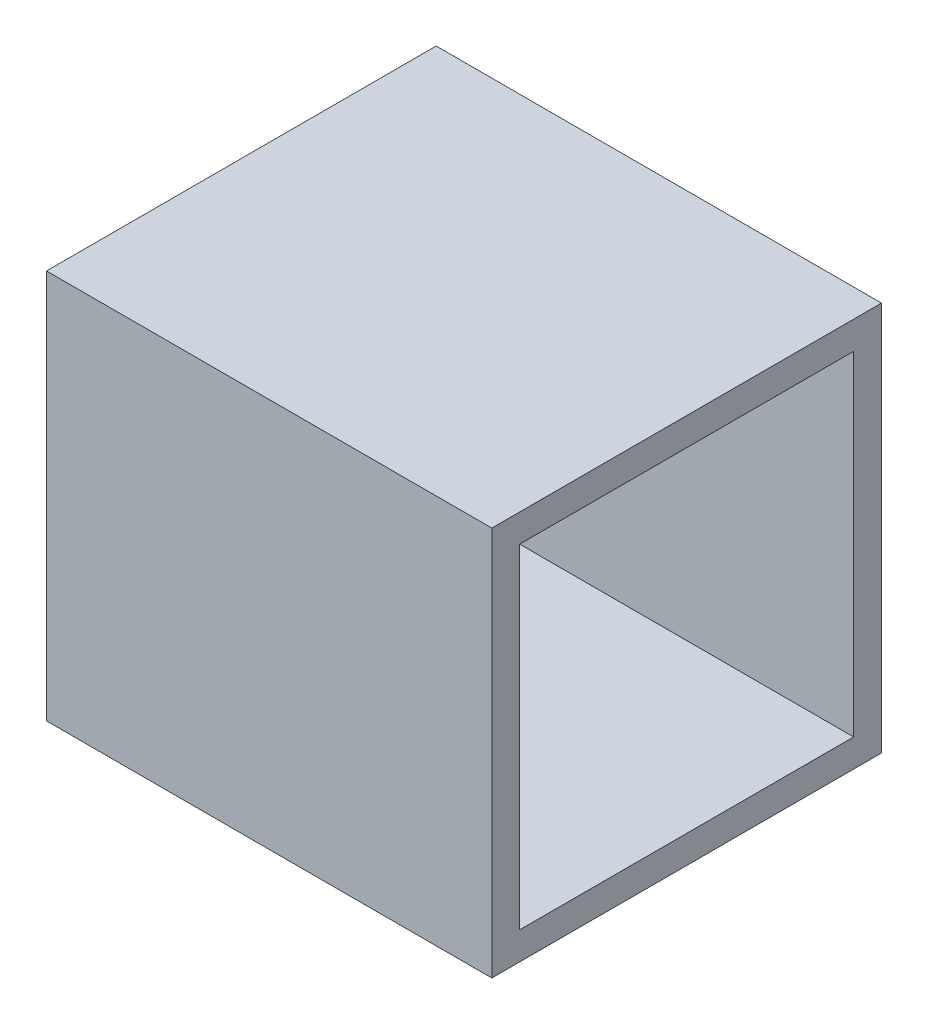
ISO-10303-21;
HEADER;
FILE_DESCRIPTION(('STEP AP214'),'2;1');
FILE_NAME('part.step','',(''),(''),'','','');
FILE_SCHEMA(('AUTOMOTIVE_DESIGN { 1 0 10303 214 1 1 1 1 }'));
ENDSEC;
DATA;
#1=APPLICATION_CONTEXT('core data for automotive mechanical design processes');
#2=APPLICATION_PROTOCOL_DEFINITION('international standard','automotive_design',2000,#1);
#3=PRODUCT_CONTEXT('',#1,'mechanical');
#4=PRODUCT('Part','Part','',(#3));
#5=PRODUCT_RELATED_PRODUCT_CATEGORY('part','',(#4));
#6=PRODUCT_DEFINITION_FORMATION('','',#4);
#7=PRODUCT_DEFINITION_CONTEXT('part definition',#1,'design');
#8=PRODUCT_DEFINITION('design','',#6,#7);
#9=PRODUCT_DEFINITION_SHAPE('','',#8);
#10=(LENGTH_UNIT() NAMED_UNIT(*) SI_UNIT(.MILLI.,.METRE.));
#11=(NAMED_UNIT(*) PLANE_ANGLE_UNIT() SI_UNIT($,.RADIAN.));
#12=(NAMED_UNIT(*) SI_UNIT($,.STERADIAN.) SOLID_ANGLE_UNIT());
#13=UNCERTAINTY_MEASURE_WITH_UNIT(LENGTH_MEASURE(1.E-05),#10,'distance_accuracy_value','');
#14=(GEOMETRIC_REPRESENTATION_CONTEXT(3) GLOBAL_UNCERTAINTY_ASSIGNED_CONTEXT((#13)) GLOBAL_UNIT_ASSIGNED_CONTEXT((#10,
#11,#12)) REPRESENTATION_CONTEXT('',''));
#15=CARTESIAN_POINT('',(0.,0.,0.));
#16=DIRECTION('',(0.,0.,1.));
#17=DIRECTION('',(1.,0.,0.));
#18=AXIS2_PLACEMENT_3D('',#15,#16,#17);
#19=CARTESIAN_POINT('',(0.,0.7,0.));
#20=DIRECTION('',(1.,0.,0.));
#21=DIRECTION('',(0.,0.,-1.));
#22=AXIS2_PLACEMENT_3D('',#19,#20,#21);
#23=PLANE('',#22);
#24=DIRECTION('',(0.,0.,1.));
#25=VECTOR('',#24,1.);
#26=CARTESIAN_POINT('',(0.,0.65,0.65));
#27=LINE('',#26,#25);
#28=CARTESIAN_POINT('',(0.,0.65,0.0500000000000002));
#29=VERTEX_POINT('',#28);
#30=CARTESIAN_POINT('',(0.,0.65,0.65));
#31=VERTEX_POINT('',#30);
#32=EDGE_CURVE('E115',#29,#31,#27,.T.);
#33=ORIENTED_EDGE('',*,*,#32,.T.);
#34=DIRECTION('',(0.,-1.,0.));
#35=VECTOR('',#34,1.);
#36=CARTESIAN_POINT('',(0.,0.65,0.65));
#37=LINE('',#36,#35);
#38=CARTESIAN_POINT('',(0.,0.05,0.65));
#39=VERTEX_POINT('',#38);
#40=EDGE_CURVE('E110',#31,#39,#37,.T.);
#41=ORIENTED_EDGE('',*,*,#40,.T.);
#42=DIRECTION('',(0.,0.,-1.));
#43=VECTOR('',#42,1.);
#44=CARTESIAN_POINT('',(0.,0.05,0.65));
#45=LINE('',#44,#43);
#46=CARTESIAN_POINT('',(0.,0.05,0.05));
#47=VERTEX_POINT('',#46);
#48=EDGE_CURVE('E118',#39,#47,#45,.T.);
#49=ORIENTED_EDGE('',*,*,#48,.T.);
#50=DIRECTION('',(0.,1.,0.));
#51=VECTOR('',#50,1.);
#52=CARTESIAN_POINT('',(0.,0.65,0.0500000000000002));
#53=LINE('',#52,#51);
#54=EDGE_CURVE('E57',#47,#29,#53,.T.);
#55=ORIENTED_EDGE('',*,*,#54,.T.);
#56=EDGE_LOOP('',(#33,#41,#49,#55));
#57=FACE_BOUND('',#56,.T.);
#58=DIRECTION('',(0.,0.,1.));
#59=VECTOR('',#58,1.);
#60=CARTESIAN_POINT('',(0.,0.,0.));
#61=LINE('',#60,#59);
#62=CARTESIAN_POINT('',(0.,0.,0.));
#63=VERTEX_POINT('',#62);
#64=CARTESIAN_POINT('',(0.,0.,0.7));
#65=VERTEX_POINT('',#64);
#66=EDGE_CURVE('E135',#63,#65,#61,.T.);
#67=ORIENTED_EDGE('',*,*,#66,.T.);
#68=DIRECTION('',(0.,-1.,0.));
#69=VECTOR('',#68,1.);
#70=CARTESIAN_POINT('',(0.,0.7,0.7));
#71=LINE('',#70,#69);
#72=CARTESIAN_POINT('',(0.,0.7,0.7));
#73=VERTEX_POINT('',#72);
#74=EDGE_CURVE('E179',#73,#65,#71,.T.);
#75=ORIENTED_EDGE('',*,*,#74,.F.);
#76=DIRECTION('',(0.,0.,1.));
#77=VECTOR('',#76,1.);
#78=CARTESIAN_POINT('',(0.,0.7,0.));
#79=LINE('',#78,#77);
#80=CARTESIAN_POINT('',(0.,0.7,0.));
#81=VERTEX_POINT('',#80);
#82=EDGE_CURVE('E142',#81,#73,#79,.T.);
#83=ORIENTED_EDGE('',*,*,#82,.F.);
#84=DIRECTION('',(0.,-1.,0.));
#85=VECTOR('',#84,1.);
#86=CARTESIAN_POINT('',(0.,0.7,0.));
#87=LINE('',#86,#85);
#88=EDGE_CURVE('E156',#81,#63,#87,.T.);
#89=ORIENTED_EDGE('',*,*,#88,.T.);
#90=EDGE_LOOP('',(#67,#75,#83,#89));
#91=FACE_BOUND('',#90,.T.);
#92=ADVANCED_FACE('F42',(#57,#91),#23,.F.);
#93=CARTESIAN_POINT('',(0.,0.7,0.7));
#94=DIRECTION('',(0.,0.,-1.));
#95=DIRECTION('',(-1.,0.,0.));
#96=AXIS2_PLACEMENT_3D('',#93,#94,#95);
#97=PLANE('',#96);
#98=DIRECTION('',(1.,0.,0.));
#99=VECTOR('',#98,1.);
#100=CARTESIAN_POINT('',(0.,0.,0.7));
#101=LINE('',#100,#99);
#102=CARTESIAN_POINT('',(0.8,0.,0.7));
#103=VERTEX_POINT('',#102);
#104=EDGE_CURVE('E160',#65,#103,#101,.T.);
#105=ORIENTED_EDGE('',*,*,#104,.T.);
#106=DIRECTION('',(0.,-1.,0.));
#107=VECTOR('',#106,1.);
#108=CARTESIAN_POINT('',(0.8,0.7,0.7));
#109=LINE('',#108,#107);
#110=CARTESIAN_POINT('',(0.8,0.7,0.7));
#111=VERTEX_POINT('',#110);
#112=EDGE_CURVE('E175',#111,#103,#109,.T.);
#113=ORIENTED_EDGE('',*,*,#112,.F.);
#114=DIRECTION('',(1.,0.,0.));
#115=VECTOR('',#114,1.);
#116=CARTESIAN_POINT('',(0.,0.7,0.7));
#117=LINE('',#116,#115);
#118=EDGE_CURVE('E146',#73,#111,#117,.T.);
#119=ORIENTED_EDGE('',*,*,#118,.F.);
#120=ORIENTED_EDGE('',*,*,#74,.T.);
#121=EDGE_LOOP('',(#105,#113,#119,#120));
#122=FACE_BOUND('',#121,.T.);
#123=ADVANCED_FACE('F206',(#122),#97,.F.);
#124=CARTESIAN_POINT('',(0.8,0.7,0.));
#125=DIRECTION('',(-1.,0.,0.));
#126=DIRECTION('',(0.,0.,1.));
#127=AXIS2_PLACEMENT_3D('',#124,#125,#126);
#128=PLANE('',#127);
#129=DIRECTION('',(0.,0.,1.));
#130=VECTOR('',#129,1.);
#131=CARTESIAN_POINT('',(0.8,0.05,0.));
#132=LINE('',#131,#130);
#133=CARTESIAN_POINT('',(0.8,0.05,0.05));
#134=VERTEX_POINT('',#133);
#135=CARTESIAN_POINT('',(0.8,0.05,0.65));
#136=VERTEX_POINT('',#135);
#137=EDGE_CURVE('E183',#134,#136,#132,.T.);
#138=ORIENTED_EDGE('',*,*,#137,.T.);
#139=DIRECTION('',(0.,1.,0.));
#140=VECTOR('',#139,1.);
#141=CARTESIAN_POINT('',(0.8,0.7,0.65));
#142=LINE('',#141,#140);
#143=CARTESIAN_POINT('',(0.8,0.65,0.65));
#144=VERTEX_POINT('',#143);
#145=EDGE_CURVE('E11',#136,#144,#142,.T.);
#146=ORIENTED_EDGE('',*,*,#145,.T.);
#147=DIRECTION('',(0.,0.,-1.));
#148=VECTOR('',#147,1.);
#149=CARTESIAN_POINT('',(0.8,0.65,0.));
#150=LINE('',#149,#148);
#151=CARTESIAN_POINT('',(0.8,0.65,0.05));
#152=VERTEX_POINT('',#151);
#153=EDGE_CURVE('E50',#144,#152,#150,.T.);
#154=ORIENTED_EDGE('',*,*,#153,.T.);
#155=DIRECTION('',(0.,-1.,0.));
#156=VECTOR('',#155,1.);
#157=CARTESIAN_POINT('',(0.8,0.7,0.05));
#158=LINE('',#157,#156);
#159=EDGE_CURVE('E186',#152,#134,#158,.T.);
#160=ORIENTED_EDGE('',*,*,#159,.T.);
#161=EDGE_LOOP('',(#138,#146,#154,#160));
#162=FACE_BOUND('',#161,.T.);
#163=DIRECTION('',(0.,0.,-1.));
#164=VECTOR('',#163,1.);
#165=CARTESIAN_POINT('',(0.8,0.,0.));
#166=LINE('',#165,#164);
#167=CARTESIAN_POINT('',(0.8,0.,0.));
#168=VERTEX_POINT('',#167);
#169=EDGE_CURVE('E163',#103,#168,#166,.T.);
#170=ORIENTED_EDGE('',*,*,#169,.T.);
#171=DIRECTION('',(0.,-1.,0.));
#172=VECTOR('',#171,1.);
#173=CARTESIAN_POINT('',(0.8,0.7,0.));
#174=LINE('',#173,#172);
#175=CARTESIAN_POINT('',(0.8,0.7,0.));
#176=VERTEX_POINT('',#175);
#177=EDGE_CURVE('E171',#176,#168,#174,.T.);
#178=ORIENTED_EDGE('',*,*,#177,.F.);
#179=DIRECTION('',(0.,0.,-1.));
#180=VECTOR('',#179,1.);
#181=CARTESIAN_POINT('',(0.8,0.7,0.));
#182=LINE('',#181,#180);
#183=EDGE_CURVE('E150',#111,#176,#182,.T.);
#184=ORIENTED_EDGE('',*,*,#183,.F.);
#185=ORIENTED_EDGE('',*,*,#112,.T.);
#186=EDGE_LOOP('',(#170,#178,#184,#185));
#187=FACE_BOUND('',#186,.T.);
#188=ADVANCED_FACE('F192',(#162,#187),#128,.F.);
#189=CARTESIAN_POINT('',(0.,0.7,0.));
#190=DIRECTION('',(0.,0.,1.));
#191=DIRECTION('',(1.,0.,0.));
#192=AXIS2_PLACEMENT_3D('',#189,#190,#191);
#193=PLANE('',#192);
#194=DIRECTION('',(-1.,0.,0.));
#195=VECTOR('',#194,1.);
#196=CARTESIAN_POINT('',(0.,0.,0.));
#197=LINE('',#196,#195);
#198=EDGE_CURVE('E147',#168,#63,#197,.T.);
#199=ORIENTED_EDGE('',*,*,#198,.T.);
#200=ORIENTED_EDGE('',*,*,#88,.F.);
#201=DIRECTION('',(-1.,0.,0.));
#202=VECTOR('',#201,1.);
#203=CARTESIAN_POINT('',(0.,0.7,0.));
#204=LINE('',#203,#202);
#205=EDGE_CURVE('E153',#176,#81,#204,.T.);
#206=ORIENTED_EDGE('',*,*,#205,.F.);
#207=ORIENTED_EDGE('',*,*,#177,.T.);
#208=EDGE_LOOP('',(#199,#200,#206,#207));
#209=FACE_BOUND('',#208,.T.);
#210=ADVANCED_FACE('F214',(#209),#193,.F.);
#211=CARTESIAN_POINT('',(0.,0.7,0.));
#212=DIRECTION('',(0.,1.,0.));
#213=DIRECTION('',(0.,0.,1.));
#214=AXIS2_PLACEMENT_3D('',#211,#212,#213);
#215=PLANE('',#214);
#216=ORIENTED_EDGE('',*,*,#82,.T.);
#217=ORIENTED_EDGE('',*,*,#118,.T.);
#218=ORIENTED_EDGE('',*,*,#183,.T.);
#219=ORIENTED_EDGE('',*,*,#205,.T.);
#220=EDGE_LOOP('',(#216,#217,#218,#219));
#221=FACE_BOUND('',#220,.T.);
#222=ADVANCED_FACE('F219',(#221),#215,.T.);
#223=CARTESIAN_POINT('',(0.,0.,0.));
#224=DIRECTION('',(0.,1.,0.));
#225=DIRECTION('',(0.,0.,1.));
#226=AXIS2_PLACEMENT_3D('',#223,#224,#225);
#227=PLANE('',#226);
#228=ORIENTED_EDGE('',*,*,#66,.F.);
#229=ORIENTED_EDGE('',*,*,#198,.F.);
#230=ORIENTED_EDGE('',*,*,#169,.F.);
#231=ORIENTED_EDGE('',*,*,#104,.F.);
#232=EDGE_LOOP('',(#228,#229,#230,#231));
#233=FACE_BOUND('',#232,.T.);
#234=ADVANCED_FACE('F221',(#233),#227,.F.);
#235=CARTESIAN_POINT('',(0.,0.65,0.65));
#236=DIRECTION('',(0.,0.,1.));
#237=DIRECTION('',(1.,0.,0.));
#238=AXIS2_PLACEMENT_3D('',#235,#236,#237);
#239=PLANE('',#238);
#240=DIRECTION('',(1.,0.,0.));
#241=VECTOR('',#240,1.);
#242=CARTESIAN_POINT('',(0.,0.05,0.65));
#243=LINE('',#242,#241);
#244=EDGE_CURVE('E65',#39,#136,#243,.T.);
#245=ORIENTED_EDGE('',*,*,#244,.F.);
#246=ORIENTED_EDGE('',*,*,#40,.F.);
#247=DIRECTION('',(1.,0.,0.));
#248=VECTOR('',#247,1.);
#249=CARTESIAN_POINT('',(0.,0.65,0.65));
#250=LINE('',#249,#248);
#251=EDGE_CURVE('E132',#31,#144,#250,.T.);
#252=ORIENTED_EDGE('',*,*,#251,.T.);
#253=ORIENTED_EDGE('',*,*,#145,.F.);
#254=EDGE_LOOP('',(#245,#246,#252,#253));
#255=FACE_BOUND('',#254,.T.);
#256=ADVANCED_FACE('F107',(#255),#239,.F.);
#257=CARTESIAN_POINT('',(0.,0.65,0.65));
#258=DIRECTION('',(0.,1.,0.));
#259=DIRECTION('',(0.,0.,1.));
#260=AXIS2_PLACEMENT_3D('',#257,#258,#259);
#261=PLANE('',#260);
#262=ORIENTED_EDGE('',*,*,#251,.F.);
#263=ORIENTED_EDGE('',*,*,#32,.F.);
#264=DIRECTION('',(1.,0.,0.));
#265=VECTOR('',#264,1.);
#266=CARTESIAN_POINT('',(0.,0.65,0.0500000000000002));
#267=LINE('',#266,#265);
#268=EDGE_CURVE('E136',#29,#152,#267,.T.);
#269=ORIENTED_EDGE('',*,*,#268,.T.);
#270=ORIENTED_EDGE('',*,*,#153,.F.);
#271=EDGE_LOOP('',(#262,#263,#269,#270));
#272=FACE_BOUND('',#271,.T.);
#273=ADVANCED_FACE('F195',(#272),#261,.F.);
#274=CARTESIAN_POINT('',(0.,0.65,0.0500000000000002));
#275=DIRECTION('',(0.,0.,-1.));
#276=DIRECTION('',(-1.,0.,0.));
#277=AXIS2_PLACEMENT_3D('',#274,#275,#276);
#278=PLANE('',#277);
#279=ORIENTED_EDGE('',*,*,#268,.F.);
#280=ORIENTED_EDGE('',*,*,#54,.F.);
#281=DIRECTION('',(1.,0.,0.));
#282=VECTOR('',#281,1.);
#283=CARTESIAN_POINT('',(0.,0.05,0.0500000000000002));
#284=LINE('',#283,#282);
#285=EDGE_CURVE('E114',#47,#134,#284,.T.);
#286=ORIENTED_EDGE('',*,*,#285,.T.);
#287=ORIENTED_EDGE('',*,*,#159,.F.);
#288=EDGE_LOOP('',(#279,#280,#286,#287));
#289=FACE_BOUND('',#288,.T.);
#290=ADVANCED_FACE('F196',(#289),#278,.F.);
#291=CARTESIAN_POINT('',(0.,0.05,0.65));
#292=DIRECTION('',(0.,-1.,0.));
#293=DIRECTION('',(0.,0.,-1.));
#294=AXIS2_PLACEMENT_3D('',#291,#292,#293);
#295=PLANE('',#294);
#296=ORIENTED_EDGE('',*,*,#285,.F.);
#297=ORIENTED_EDGE('',*,*,#48,.F.);
#298=ORIENTED_EDGE('',*,*,#244,.T.);
#299=ORIENTED_EDGE('',*,*,#137,.F.);
#300=EDGE_LOOP('',(#296,#297,#298,#299));
#301=FACE_BOUND('',#300,.T.);
#302=ADVANCED_FACE('F119',(#301),#295,.F.);
#303=CLOSED_SHELL('',(#92,#123,#188,#210,#222,#234,#256,#273,#290,#302));
#304=MANIFOLD_SOLID_BREP('B2',#303);
#305=ADVANCED_BREP_SHAPE_REPRESENTATION('',(#18,#304),#14);
#306=SHAPE_DEFINITION_REPRESENTATION(#9,#305);
ENDSEC;
END-ISO-10303-21;
